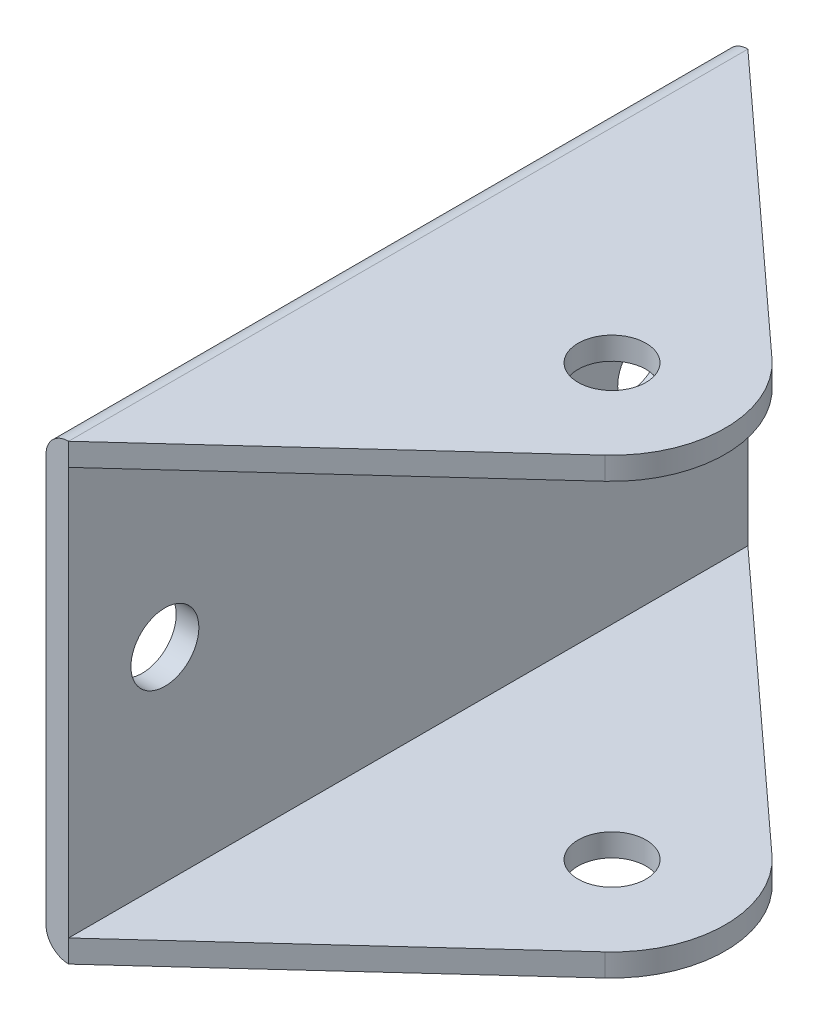
ISO-10303-21;
HEADER;
FILE_DESCRIPTION(('STEP AP214'),'2;1');
FILE_NAME('part.step','',(''),(''),'','','');
FILE_SCHEMA(('AUTOMOTIVE_DESIGN { 1 0 10303 214 1 1 1 1 }'));
ENDSEC;
DATA;
#1=APPLICATION_CONTEXT('core data for automotive mechanical design processes');
#2=APPLICATION_PROTOCOL_DEFINITION('international standard','automotive_design',2000,#1);
#3=PRODUCT_CONTEXT('',#1,'mechanical');
#4=PRODUCT('Part','Part','',(#3));
#5=PRODUCT_RELATED_PRODUCT_CATEGORY('part','',(#4));
#6=PRODUCT_DEFINITION_FORMATION('','',#4);
#7=PRODUCT_DEFINITION_CONTEXT('part definition',#1,'design');
#8=PRODUCT_DEFINITION('design','',#6,#7);
#9=PRODUCT_DEFINITION_SHAPE('','',#8);
#10=(LENGTH_UNIT() NAMED_UNIT(*) SI_UNIT(.MILLI.,.METRE.));
#11=(NAMED_UNIT(*) PLANE_ANGLE_UNIT() SI_UNIT($,.RADIAN.));
#12=(NAMED_UNIT(*) SI_UNIT($,.STERADIAN.) SOLID_ANGLE_UNIT());
#13=UNCERTAINTY_MEASURE_WITH_UNIT(LENGTH_MEASURE(1.E-05),#10,'distance_accuracy_value','');
#14=(GEOMETRIC_REPRESENTATION_CONTEXT(3) GLOBAL_UNCERTAINTY_ASSIGNED_CONTEXT((#13)) GLOBAL_UNIT_ASSIGNED_CONTEXT((#10,
#11,#12)) REPRESENTATION_CONTEXT('',''));
#15=CARTESIAN_POINT('',(0.,0.,0.));
#16=DIRECTION('',(0.,0.,1.));
#17=DIRECTION('',(1.,0.,0.));
#18=AXIS2_PLACEMENT_3D('',#15,#16,#17);
#19=CARTESIAN_POINT('',(-18.,-18.,100.));
#20=DIRECTION('',(0.,0.,-1.));
#21=DIRECTION('',(-1.,0.,0.));
#22=AXIS2_PLACEMENT_3D('',#19,#20,#21);
#23=CYLINDRICAL_SURFACE('',#22,2.);
#24=CARTESIAN_POINT('',(-18.,-18.,80.));
#25=DIRECTION('',(0.,0.,1.));
#26=DIRECTION('',(1.,0.,0.));
#27=AXIS2_PLACEMENT_3D('',#24,#25,#26);
#28=CIRCLE('',#27,2.);
#29=CARTESIAN_POINT('',(-20.,-18.,80.));
#30=VERTEX_POINT('',#29);
#31=CARTESIAN_POINT('',(-18.,-20.,80.));
#32=VERTEX_POINT('',#31);
#33=EDGE_CURVE('E169',#30,#32,#28,.T.);
#34=ORIENTED_EDGE('',*,*,#33,.F.);
#35=DIRECTION('',(0.,0.,-1.));
#36=VECTOR('',#35,1.);
#37=CARTESIAN_POINT('',(-20.,-18.,100.));
#38=LINE('',#37,#36);
#39=CARTESIAN_POINT('',(-20.,-18.,20.));
#40=VERTEX_POINT('',#39);
#41=EDGE_CURVE('E188',#30,#40,#38,.T.);
#42=ORIENTED_EDGE('',*,*,#41,.T.);
#43=CARTESIAN_POINT('',(-18.,-18.,20.));
#44=DIRECTION('',(0.,0.,-1.));
#45=DIRECTION('',(-1.,0.,0.));
#46=AXIS2_PLACEMENT_3D('',#43,#44,#45);
#47=CIRCLE('',#46,2.);
#48=CARTESIAN_POINT('',(-18.,-20.,20.));
#49=VERTEX_POINT('',#48);
#50=EDGE_CURVE('E60',#49,#40,#47,.T.);
#51=ORIENTED_EDGE('',*,*,#50,.F.);
#52=DIRECTION('',(0.,0.,-1.));
#53=VECTOR('',#52,1.);
#54=CARTESIAN_POINT('',(-18.,-20.,100.));
#55=LINE('',#54,#53);
#56=EDGE_CURVE('E196',#32,#49,#55,.T.);
#57=ORIENTED_EDGE('',*,*,#56,.F.);
#58=EDGE_LOOP('',(#34,#42,#51,#57));
#59=FACE_BOUND('',#58,.T.);
#60=ADVANCED_FACE('F42',(#59),#23,.T.);
#61=CARTESIAN_POINT('',(-18.,-20.,100.));
#62=DIRECTION('',(0.,1.,0.));
#63=DIRECTION('',(0.,0.,1.));
#64=AXIS2_PLACEMENT_3D('',#61,#62,#63);
#65=PLANE('',#64);
#66=CARTESIAN_POINT('',(0.,-20.,50.));
#67=DIRECTION('',(0.,1.,0.));
#68=DIRECTION('',(0.,0.,1.));
#69=AXIS2_PLACEMENT_3D('',#66,#67,#68);
#70=CIRCLE('',#69,3.);
#71=CARTESIAN_POINT('',(0.,-20.,53.));
#72=VERTEX_POINT('',#71);
#73=EDGE_CURVE('E172',#72,#72,#70,.T.);
#74=ORIENTED_EDGE('',*,*,#73,.T.);
#75=EDGE_LOOP('',(#74));
#76=FACE_BOUND('',#75,.T.);
#77=DIRECTION('',(0.738129057281575,0.,-0.674659539913736));
#78=VECTOR('',#77,1.);
#79=CARTESIAN_POINT('',(-18.,-20.,80.));
#80=LINE('',#79,#78);
#81=CARTESIAN_POINT('',(6.74659539913737,-20.,57.3812905728158));
#82=VERTEX_POINT('',#81);
#83=EDGE_CURVE('E108',#32,#82,#80,.T.);
#84=ORIENTED_EDGE('',*,*,#83,.F.);
#85=ORIENTED_EDGE('',*,*,#56,.T.);
#86=DIRECTION('',(-0.738129057281575,0.,-0.674659539913736));
#87=VECTOR('',#86,1.);
#88=CARTESIAN_POINT('',(6.74659539913737,-20.,42.6187094271843));
#89=LINE('',#88,#87);
#90=CARTESIAN_POINT('',(6.74659539913737,-20.,42.6187094271843));
#91=VERTEX_POINT('',#90);
#92=EDGE_CURVE('E135',#91,#49,#89,.T.);
#93=ORIENTED_EDGE('',*,*,#92,.F.);
#94=CARTESIAN_POINT('',(0.,-20.,50.));
#95=DIRECTION('',(0.,1.,0.));
#96=DIRECTION('',(0.,0.,-1.));
#97=AXIS2_PLACEMENT_3D('',#94,#95,#96);
#98=CIRCLE('',#97,10.);
#99=EDGE_CURVE('E124',#82,#91,#98,.T.);
#100=ORIENTED_EDGE('',*,*,#99,.F.);
#101=EDGE_LOOP('',(#84,#85,#93,#100));
#102=FACE_BOUND('',#101,.T.);
#103=ADVANCED_FACE('F231',(#76,#102),#65,.F.);
#104=CARTESIAN_POINT('',(-18.,20.,100.));
#105=DIRECTION('',(0.,-1.,0.));
#106=DIRECTION('',(0.,0.,-1.));
#107=AXIS2_PLACEMENT_3D('',#104,#105,#106);
#108=PLANE('',#107);
#109=CARTESIAN_POINT('',(0.,20.,50.));
#110=DIRECTION('',(0.,-1.,0.));
#111=DIRECTION('',(0.,0.,-1.));
#112=AXIS2_PLACEMENT_3D('',#109,#110,#111);
#113=CIRCLE('',#112,3.);
#114=CARTESIAN_POINT('',(0.,20.,47.));
#115=VERTEX_POINT('',#114);
#116=EDGE_CURVE('E179',#115,#115,#113,.T.);
#117=ORIENTED_EDGE('',*,*,#116,.T.);
#118=EDGE_LOOP('',(#117));
#119=FACE_BOUND('',#118,.T.);
#120=DIRECTION('',(-0.738129057281575,0.,0.674659539913736));
#121=VECTOR('',#120,1.);
#122=CARTESIAN_POINT('',(-27.9597162036509,20.,89.1033098959323));
#123=LINE('',#122,#121);
#124=CARTESIAN_POINT('',(6.74659539913736,20.,57.3812905728158));
#125=VERTEX_POINT('',#124);
#126=CARTESIAN_POINT('',(-18.,20.,80.));
#127=VERTEX_POINT('',#126);
#128=EDGE_CURVE('E111',#125,#127,#123,.T.);
#129=ORIENTED_EDGE('',*,*,#128,.F.);
#130=CARTESIAN_POINT('',(0.,20.,50.));
#131=DIRECTION('',(0.,1.,0.));
#132=DIRECTION('',(0.,0.,1.));
#133=AXIS2_PLACEMENT_3D('',#130,#131,#132);
#134=CIRCLE('',#133,10.);
#135=CARTESIAN_POINT('',(6.74659539913737,20.,42.6187094271843));
#136=VERTEX_POINT('',#135);
#137=EDGE_CURVE('E103',#125,#136,#134,.T.);
#138=ORIENTED_EDGE('',*,*,#137,.T.);
#139=DIRECTION('',(0.738129057281575,0.,0.674659539913736));
#140=VECTOR('',#139,1.);
#141=CARTESIAN_POINT('',(21.8388648146038,20.,56.4132395837291));
#142=LINE('',#141,#140);
#143=CARTESIAN_POINT('',(-18.,20.,20.));
#144=VERTEX_POINT('',#143);
#145=EDGE_CURVE('E83',#144,#136,#142,.T.);
#146=ORIENTED_EDGE('',*,*,#145,.F.);
#147=DIRECTION('',(0.,0.,-1.));
#148=VECTOR('',#147,1.);
#149=CARTESIAN_POINT('',(-18.,20.,100.));
#150=LINE('',#149,#148);
#151=EDGE_CURVE('E194',#127,#144,#150,.T.);
#152=ORIENTED_EDGE('',*,*,#151,.F.);
#153=EDGE_LOOP('',(#129,#138,#146,#152));
#154=FACE_BOUND('',#153,.T.);
#155=ADVANCED_FACE('F110',(#119,#154),#108,.F.);
#156=CARTESIAN_POINT('',(-18.,18.,100.));
#157=DIRECTION('',(0.,0.,-1.));
#158=DIRECTION('',(-1.,0.,0.));
#159=AXIS2_PLACEMENT_3D('',#156,#157,#158);
#160=CYLINDRICAL_SURFACE('',#159,2.);
#161=CARTESIAN_POINT('',(-18.,18.,80.));
#162=DIRECTION('',(0.,0.,1.));
#163=DIRECTION('',(1.,0.,0.));
#164=AXIS2_PLACEMENT_3D('',#161,#162,#163);
#165=CIRCLE('',#164,2.);
#166=CARTESIAN_POINT('',(-20.,18.,80.));
#167=VERTEX_POINT('',#166);
#168=EDGE_CURVE('E166',#127,#167,#165,.T.);
#169=ORIENTED_EDGE('',*,*,#168,.F.);
#170=ORIENTED_EDGE('',*,*,#151,.T.);
#171=CARTESIAN_POINT('',(-18.,18.,20.));
#172=DIRECTION('',(0.,0.,-1.));
#173=DIRECTION('',(-1.,0.,0.));
#174=AXIS2_PLACEMENT_3D('',#171,#172,#173);
#175=CIRCLE('',#174,2.);
#176=CARTESIAN_POINT('',(-20.,18.,20.));
#177=VERTEX_POINT('',#176);
#178=EDGE_CURVE('E114',#177,#144,#175,.T.);
#179=ORIENTED_EDGE('',*,*,#178,.F.);
#180=DIRECTION('',(0.,0.,-1.));
#181=VECTOR('',#180,1.);
#182=CARTESIAN_POINT('',(-20.,18.,100.));
#183=LINE('',#182,#181);
#184=EDGE_CURVE('E191',#167,#177,#183,.T.);
#185=ORIENTED_EDGE('',*,*,#184,.F.);
#186=EDGE_LOOP('',(#169,#170,#179,#185));
#187=FACE_BOUND('',#186,.T.);
#188=ADVANCED_FACE('F269',(#187),#160,.T.);
#189=CARTESIAN_POINT('',(-20.,18.,100.));
#190=DIRECTION('',(1.,0.,0.));
#191=DIRECTION('',(0.,0.,-1.));
#192=AXIS2_PLACEMENT_3D('',#189,#190,#191);
#193=PLANE('',#192);
#194=CARTESIAN_POINT('',(-20.,0.,71.5));
#195=DIRECTION('',(1.,0.,0.));
#196=DIRECTION('',(0.,1.,0.));
#197=AXIS2_PLACEMENT_3D('',#194,#195,#196);
#198=CIRCLE('',#197,3.00000000000001);
#199=CARTESIAN_POINT('',(-20.,3.00000000000001,71.5));
#200=VERTEX_POINT('',#199);
#201=EDGE_CURVE('E120',#200,#200,#198,.T.);
#202=ORIENTED_EDGE('',*,*,#201,.T.);
#203=EDGE_LOOP('',(#202));
#204=FACE_BOUND('',#203,.T.);
#205=CARTESIAN_POINT('',(-20.,0.,28.5));
#206=DIRECTION('',(1.,0.,0.));
#207=DIRECTION('',(0.,1.,0.));
#208=AXIS2_PLACEMENT_3D('',#205,#206,#207);
#209=CIRCLE('',#208,3.);
#210=CARTESIAN_POINT('',(-20.,3.,28.5));
#211=VERTEX_POINT('',#210);
#212=EDGE_CURVE('E126',#211,#211,#209,.T.);
#213=ORIENTED_EDGE('',*,*,#212,.T.);
#214=EDGE_LOOP('',(#213));
#215=FACE_BOUND('',#214,.T.);
#216=DIRECTION('',(0.,-1.,0.));
#217=VECTOR('',#216,1.);
#218=CARTESIAN_POINT('',(-20.,18.,80.));
#219=LINE('',#218,#217);
#220=EDGE_CURVE('E163',#167,#30,#219,.T.);
#221=ORIENTED_EDGE('',*,*,#220,.F.);
#222=ORIENTED_EDGE('',*,*,#184,.T.);
#223=DIRECTION('',(0.,1.,0.));
#224=VECTOR('',#223,1.);
#225=CARTESIAN_POINT('',(-20.,18.,20.));
#226=LINE('',#225,#224);
#227=EDGE_CURVE('E112',#40,#177,#226,.T.);
#228=ORIENTED_EDGE('',*,*,#227,.F.);
#229=ORIENTED_EDGE('',*,*,#41,.F.);
#230=EDGE_LOOP('',(#221,#222,#228,#229));
#231=FACE_BOUND('',#230,.T.);
#232=ADVANCED_FACE('F241',(#204,#215,#231),#193,.F.);
#233=CARTESIAN_POINT('',(-18.,18.,100.));
#234=DIRECTION('',(0.,-1.,0.));
#235=DIRECTION('',(0.,0.,-1.));
#236=AXIS2_PLACEMENT_3D('',#233,#234,#235);
#237=PLANE('',#236);
#238=CARTESIAN_POINT('',(0.,18.,50.));
#239=DIRECTION('',(0.,-1.,0.));
#240=DIRECTION('',(0.,0.,-1.));
#241=AXIS2_PLACEMENT_3D('',#238,#239,#240);
#242=CIRCLE('',#241,3.);
#243=CARTESIAN_POINT('',(0.,18.,47.));
#244=VERTEX_POINT('',#243);
#245=EDGE_CURVE('E176',#244,#244,#242,.T.);
#246=ORIENTED_EDGE('',*,*,#245,.F.);
#247=EDGE_LOOP('',(#246));
#248=FACE_BOUND('',#247,.T.);
#249=CARTESIAN_POINT('',(0.,18.,50.));
#250=DIRECTION('',(0.,-1.,0.));
#251=DIRECTION('',(0.,0.,-1.));
#252=AXIS2_PLACEMENT_3D('',#249,#250,#251);
#253=CIRCLE('',#252,10.);
#254=CARTESIAN_POINT('',(6.74659539913737,18.,42.6187094271843));
#255=VERTEX_POINT('',#254);
#256=CARTESIAN_POINT('',(6.74659539913737,18.,57.3812905728158));
#257=VERTEX_POINT('',#256);
#258=EDGE_CURVE('E106',#255,#257,#253,.T.);
#259=ORIENTED_EDGE('',*,*,#258,.T.);
#260=DIRECTION('',(-0.738129057281575,0.,0.674659539913736));
#261=VECTOR('',#260,1.);
#262=CARTESIAN_POINT('',(-27.9597162036509,18.,89.1033098959323));
#263=LINE('',#262,#261);
#264=CARTESIAN_POINT('',(-18.,18.,80.));
#265=VERTEX_POINT('',#264);
#266=EDGE_CURVE('E97',#257,#265,#263,.T.);
#267=ORIENTED_EDGE('',*,*,#266,.T.);
#268=DIRECTION('',(0.,0.,-1.));
#269=VECTOR('',#268,1.);
#270=CARTESIAN_POINT('',(-18.,18.,100.));
#271=LINE('',#270,#269);
#272=CARTESIAN_POINT('',(-18.,18.,20.));
#273=VERTEX_POINT('',#272);
#274=EDGE_CURVE('E185',#265,#273,#271,.T.);
#275=ORIENTED_EDGE('',*,*,#274,.T.);
#276=DIRECTION('',(0.738129057281575,0.,0.674659539913736));
#277=VECTOR('',#276,1.);
#278=CARTESIAN_POINT('',(21.8388648146037,18.,56.4132395837291));
#279=LINE('',#278,#277);
#280=EDGE_CURVE('E98',#273,#255,#279,.T.);
#281=ORIENTED_EDGE('',*,*,#280,.T.);
#282=EDGE_LOOP('',(#259,#267,#275,#281));
#283=FACE_BOUND('',#282,.T.);
#284=ADVANCED_FACE('F273',(#248,#283),#237,.T.);
#285=CARTESIAN_POINT('',(-18.,18.,100.));
#286=DIRECTION('',(1.,0.,0.));
#287=DIRECTION('',(0.,1.,0.));
#288=AXIS2_PLACEMENT_3D('',#285,#286,#287);
#289=PLANE('',#288);
#290=CARTESIAN_POINT('',(-18.,0.,71.5));
#291=DIRECTION('',(1.,0.,0.));
#292=DIRECTION('',(0.,1.,0.));
#293=AXIS2_PLACEMENT_3D('',#290,#291,#292);
#294=CIRCLE('',#293,3.00000000000001);
#295=CARTESIAN_POINT('',(-18.,3.00000000000001,71.5));
#296=VERTEX_POINT('',#295);
#297=EDGE_CURVE('E45',#296,#296,#294,.T.);
#298=ORIENTED_EDGE('',*,*,#297,.F.);
#299=EDGE_LOOP('',(#298));
#300=FACE_BOUND('',#299,.T.);
#301=CARTESIAN_POINT('',(-18.,0.,28.5));
#302=DIRECTION('',(1.,0.,0.));
#303=DIRECTION('',(0.,1.,0.));
#304=AXIS2_PLACEMENT_3D('',#301,#302,#303);
#305=CIRCLE('',#304,3.);
#306=CARTESIAN_POINT('',(-18.,3.,28.5));
#307=VERTEX_POINT('',#306);
#308=EDGE_CURVE('E118',#307,#307,#305,.T.);
#309=ORIENTED_EDGE('',*,*,#308,.F.);
#310=EDGE_LOOP('',(#309));
#311=FACE_BOUND('',#310,.T.);
#312=ORIENTED_EDGE('',*,*,#274,.F.);
#313=DIRECTION('',(0.,1.,0.));
#314=VECTOR('',#313,1.);
#315=CARTESIAN_POINT('',(-18.,-20.,80.));
#316=LINE('',#315,#314);
#317=CARTESIAN_POINT('',(-18.,-18.,80.));
#318=VERTEX_POINT('',#317);
#319=EDGE_CURVE('E143',#318,#265,#316,.T.);
#320=ORIENTED_EDGE('',*,*,#319,.F.);
#321=DIRECTION('',(0.,0.,-1.));
#322=VECTOR('',#321,1.);
#323=CARTESIAN_POINT('',(-18.,-18.,100.));
#324=LINE('',#323,#322);
#325=CARTESIAN_POINT('',(-18.,-18.,20.));
#326=VERTEX_POINT('',#325);
#327=EDGE_CURVE('E182',#318,#326,#324,.T.);
#328=ORIENTED_EDGE('',*,*,#327,.T.);
#329=DIRECTION('',(0.,1.,0.));
#330=VECTOR('',#329,1.);
#331=CARTESIAN_POINT('',(-18.,-20.,20.));
#332=LINE('',#331,#330);
#333=EDGE_CURVE('E147',#326,#273,#332,.T.);
#334=ORIENTED_EDGE('',*,*,#333,.T.);
#335=EDGE_LOOP('',(#312,#320,#328,#334));
#336=FACE_BOUND('',#335,.T.);
#337=ADVANCED_FACE('F265',(#300,#311,#336),#289,.T.);
#338=CARTESIAN_POINT('',(-18.,-18.,100.));
#339=DIRECTION('',(0.,1.,0.));
#340=DIRECTION('',(0.,0.,1.));
#341=AXIS2_PLACEMENT_3D('',#338,#339,#340);
#342=PLANE('',#341);
#343=CARTESIAN_POINT('',(0.,-18.,50.));
#344=DIRECTION('',(0.,1.,0.));
#345=DIRECTION('',(0.,0.,1.));
#346=AXIS2_PLACEMENT_3D('',#343,#344,#345);
#347=CIRCLE('',#346,3.);
#348=CARTESIAN_POINT('',(0.,-18.,53.));
#349=VERTEX_POINT('',#348);
#350=EDGE_CURVE('E175',#349,#349,#347,.T.);
#351=ORIENTED_EDGE('',*,*,#350,.F.);
#352=EDGE_LOOP('',(#351));
#353=FACE_BOUND('',#352,.T.);
#354=ORIENTED_EDGE('',*,*,#327,.F.);
#355=DIRECTION('',(0.738129057281575,0.,-0.674659539913736));
#356=VECTOR('',#355,1.);
#357=CARTESIAN_POINT('',(-27.9597162036509,-18.,89.1033098959323));
#358=LINE('',#357,#356);
#359=CARTESIAN_POINT('',(6.74659539913737,-18.,57.3812905728158));
#360=VERTEX_POINT('',#359);
#361=EDGE_CURVE('E12',#318,#360,#358,.T.);
#362=ORIENTED_EDGE('',*,*,#361,.T.);
#363=CARTESIAN_POINT('',(0.,-18.,50.));
#364=DIRECTION('',(0.,1.,0.));
#365=DIRECTION('',(0.,0.,1.));
#366=AXIS2_PLACEMENT_3D('',#363,#364,#365);
#367=CIRCLE('',#366,10.);
#368=CARTESIAN_POINT('',(6.74659539913737,-18.,42.6187094271843));
#369=VERTEX_POINT('',#368);
#370=EDGE_CURVE('E51',#360,#369,#367,.T.);
#371=ORIENTED_EDGE('',*,*,#370,.T.);
#372=DIRECTION('',(-0.738129057281575,0.,-0.674659539913736));
#373=VECTOR('',#372,1.);
#374=CARTESIAN_POINT('',(21.8388648146037,-18.,56.4132395837291));
#375=LINE('',#374,#373);
#376=EDGE_CURVE('E199',#369,#326,#375,.T.);
#377=ORIENTED_EDGE('',*,*,#376,.T.);
#378=EDGE_LOOP('',(#354,#362,#371,#377));
#379=FACE_BOUND('',#378,.T.);
#380=ADVANCED_FACE('F208',(#353,#379),#342,.T.);
#381=CARTESIAN_POINT('',(0.,-20.,50.));
#382=DIRECTION('',(0.,1.,0.));
#383=DIRECTION('',(0.,0.,1.));
#384=AXIS2_PLACEMENT_3D('',#381,#382,#383);
#385=CYLINDRICAL_SURFACE('',#384,3.);
#386=ORIENTED_EDGE('',*,*,#350,.T.);
#387=EDGE_LOOP('',(#386));
#388=FACE_BOUND('',#387,.T.);
#389=ORIENTED_EDGE('',*,*,#73,.F.);
#390=EDGE_LOOP('',(#389));
#391=FACE_BOUND('',#390,.T.);
#392=ADVANCED_FACE('F310',(#388,#391),#385,.F.);
#393=ORIENTED_EDGE('',*,*,#245,.T.);
#394=EDGE_LOOP('',(#393));
#395=FACE_BOUND('',#394,.T.);
#396=ORIENTED_EDGE('',*,*,#116,.F.);
#397=EDGE_LOOP('',(#396));
#398=FACE_BOUND('',#397,.T.);
#399=ADVANCED_FACE('F313',(#395,#398),#385,.F.);
#400=CARTESIAN_POINT('',(-21.8374101066653,-20.,80.));
#401=DIRECTION('',(0.,0.,1.));
#402=DIRECTION('',(1.,0.,0.));
#403=AXIS2_PLACEMENT_3D('',#400,#401,#402);
#404=PLANE('',#403);
#405=ORIENTED_EDGE('',*,*,#33,.T.);
#406=EDGE_CURVE('E140',#32,#318,#316,.T.);
#407=ORIENTED_EDGE('',*,*,#406,.T.);
#408=ORIENTED_EDGE('',*,*,#319,.T.);
#409=EDGE_CURVE('E144',#265,#127,#316,.T.);
#410=ORIENTED_EDGE('',*,*,#409,.T.);
#411=ORIENTED_EDGE('',*,*,#168,.T.);
#412=ORIENTED_EDGE('',*,*,#220,.T.);
#413=EDGE_LOOP('',(#405,#407,#408,#410,#411,#412));
#414=FACE_BOUND('',#413,.T.);
#415=ADVANCED_FACE('F259',(#414),#404,.T.);
#416=CARTESIAN_POINT('',(-18.,-20.,20.));
#417=DIRECTION('',(0.,0.,-1.));
#418=DIRECTION('',(-1.,0.,0.));
#419=AXIS2_PLACEMENT_3D('',#416,#417,#418);
#420=PLANE('',#419);
#421=ORIENTED_EDGE('',*,*,#50,.T.);
#422=ORIENTED_EDGE('',*,*,#227,.T.);
#423=ORIENTED_EDGE('',*,*,#178,.T.);
#424=EDGE_CURVE('E92',#273,#144,#332,.T.);
#425=ORIENTED_EDGE('',*,*,#424,.F.);
#426=ORIENTED_EDGE('',*,*,#333,.F.);
#427=EDGE_CURVE('E145',#49,#326,#332,.T.);
#428=ORIENTED_EDGE('',*,*,#427,.F.);
#429=EDGE_LOOP('',(#421,#422,#423,#425,#426,#428));
#430=FACE_BOUND('',#429,.T.);
#431=ADVANCED_FACE('F271',(#430),#420,.T.);
#432=CARTESIAN_POINT('',(0.,-20.,50.));
#433=DIRECTION('',(0.,1.,0.));
#434=DIRECTION('',(0.,0.,1.));
#435=AXIS2_PLACEMENT_3D('',#432,#433,#434);
#436=CYLINDRICAL_SURFACE('',#435,10.);
#437=ORIENTED_EDGE('',*,*,#137,.F.);
#438=DIRECTION('',(0.,1.,0.));
#439=VECTOR('',#438,1.);
#440=CARTESIAN_POINT('',(6.74659539913737,-20.,57.3812905728158));
#441=LINE('',#440,#439);
#442=EDGE_CURVE('E73',#257,#125,#441,.T.);
#443=ORIENTED_EDGE('',*,*,#442,.F.);
#444=ORIENTED_EDGE('',*,*,#258,.F.);
#445=DIRECTION('',(0.,1.,0.));
#446=VECTOR('',#445,1.);
#447=CARTESIAN_POINT('',(6.74659539913737,-20.,42.6187094271843));
#448=LINE('',#447,#446);
#449=EDGE_CURVE('E88',#255,#136,#448,.T.);
#450=ORIENTED_EDGE('',*,*,#449,.T.);
#451=EDGE_LOOP('',(#437,#443,#444,#450));
#452=FACE_BOUND('',#451,.T.);
#453=ADVANCED_FACE('F102',(#452),#436,.T.);
#454=CARTESIAN_POINT('',(-18.,-20.,80.));
#455=DIRECTION('',(0.674659539913736,0.,0.738129057281575));
#456=DIRECTION('',(0.738129057281575,0.,-0.674659539913736));
#457=AXIS2_PLACEMENT_3D('',#454,#455,#456);
#458=PLANE('',#457);
#459=ORIENTED_EDGE('',*,*,#128,.T.);
#460=ORIENTED_EDGE('',*,*,#409,.F.);
#461=ORIENTED_EDGE('',*,*,#266,.F.);
#462=ORIENTED_EDGE('',*,*,#442,.T.);
#463=EDGE_LOOP('',(#459,#460,#461,#462));
#464=FACE_BOUND('',#463,.T.);
#465=ADVANCED_FACE('F274',(#464),#458,.T.);
#466=CARTESIAN_POINT('',(6.74659539913737,-20.,42.6187094271843));
#467=DIRECTION('',(0.674659539913736,0.,-0.738129057281575));
#468=DIRECTION('',(-0.738129057281575,0.,-0.674659539913736));
#469=AXIS2_PLACEMENT_3D('',#466,#467,#468);
#470=PLANE('',#469);
#471=ORIENTED_EDGE('',*,*,#145,.T.);
#472=ORIENTED_EDGE('',*,*,#449,.F.);
#473=ORIENTED_EDGE('',*,*,#280,.F.);
#474=ORIENTED_EDGE('',*,*,#424,.T.);
#475=EDGE_LOOP('',(#471,#472,#473,#474));
#476=FACE_BOUND('',#475,.T.);
#477=ADVANCED_FACE('F85',(#476),#470,.T.);
#478=EDGE_CURVE('E148',#82,#360,#441,.T.);
#479=ORIENTED_EDGE('',*,*,#478,.F.);
#480=ORIENTED_EDGE('',*,*,#99,.T.);
#481=EDGE_CURVE('E107',#91,#369,#448,.T.);
#482=ORIENTED_EDGE('',*,*,#481,.T.);
#483=ORIENTED_EDGE('',*,*,#370,.F.);
#484=EDGE_LOOP('',(#479,#480,#482,#483));
#485=FACE_BOUND('',#484,.T.);
#486=ADVANCED_FACE('F216',(#485),#436,.T.);
#487=ORIENTED_EDGE('',*,*,#406,.F.);
#488=ORIENTED_EDGE('',*,*,#83,.T.);
#489=ORIENTED_EDGE('',*,*,#478,.T.);
#490=ORIENTED_EDGE('',*,*,#361,.F.);
#491=EDGE_LOOP('',(#487,#488,#489,#490));
#492=FACE_BOUND('',#491,.T.);
#493=ADVANCED_FACE('F223',(#492),#458,.T.);
#494=ORIENTED_EDGE('',*,*,#481,.F.);
#495=ORIENTED_EDGE('',*,*,#92,.T.);
#496=ORIENTED_EDGE('',*,*,#427,.T.);
#497=ORIENTED_EDGE('',*,*,#376,.F.);
#498=EDGE_LOOP('',(#494,#495,#496,#497));
#499=FACE_BOUND('',#498,.T.);
#500=ADVANCED_FACE('F233',(#499),#470,.T.);
#501=CARTESIAN_POINT('',(-20.,0.,28.5));
#502=DIRECTION('',(1.,0.,0.));
#503=DIRECTION('',(0.,1.,0.));
#504=AXIS2_PLACEMENT_3D('',#501,#502,#503);
#505=CYLINDRICAL_SURFACE('',#504,3.);
#506=ORIENTED_EDGE('',*,*,#308,.T.);
#507=EDGE_LOOP('',(#506));
#508=FACE_BOUND('',#507,.T.);
#509=ORIENTED_EDGE('',*,*,#212,.F.);
#510=EDGE_LOOP('',(#509));
#511=FACE_BOUND('',#510,.T.);
#512=ADVANCED_FACE('F318',(#508,#511),#505,.F.);
#513=CARTESIAN_POINT('',(-20.,0.,71.5));
#514=DIRECTION('',(1.,0.,0.));
#515=DIRECTION('',(0.,1.,0.));
#516=AXIS2_PLACEMENT_3D('',#513,#514,#515);
#517=CYLINDRICAL_SURFACE('',#516,3.00000000000001);
#518=ORIENTED_EDGE('',*,*,#297,.T.);
#519=EDGE_LOOP('',(#518));
#520=FACE_BOUND('',#519,.T.);
#521=ORIENTED_EDGE('',*,*,#201,.F.);
#522=EDGE_LOOP('',(#521));
#523=FACE_BOUND('',#522,.T.);
#524=ADVANCED_FACE('F423',(#520,#523),#517,.F.);
#525=CLOSED_SHELL('',(#60,#103,#155,#188,#232,#284,#337,#380,#392,#399,#415,#431,#453,#465,#477,
#486,#493,#500,#512,#524));
#526=MANIFOLD_SOLID_BREP('B2',#525);
#527=ADVANCED_BREP_SHAPE_REPRESENTATION('',(#18,#526),#14);
#528=SHAPE_DEFINITION_REPRESENTATION(#9,#527);
ENDSEC;
END-ISO-10303-21;
